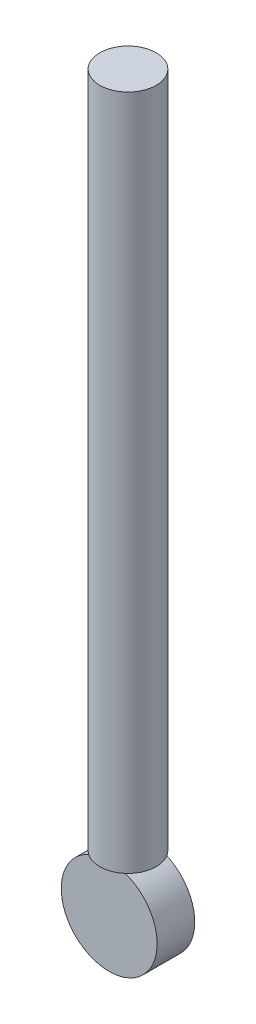
ISO-10303-21;
HEADER;
FILE_DESCRIPTION(('STEP AP214'),'2;1');
FILE_NAME('part.step','',(''),(''),'','','');
FILE_SCHEMA(('AUTOMOTIVE_DESIGN { 1 0 10303 214 1 1 1 1 }'));
ENDSEC;
DATA;
#1=APPLICATION_CONTEXT('core data for automotive mechanical design processes');
#2=APPLICATION_PROTOCOL_DEFINITION('international standard','automotive_design',2000,#1);
#3=PRODUCT_CONTEXT('',#1,'mechanical');
#4=PRODUCT('Part','Part','',(#3));
#5=PRODUCT_RELATED_PRODUCT_CATEGORY('part','',(#4));
#6=PRODUCT_DEFINITION_FORMATION('','',#4);
#7=PRODUCT_DEFINITION_CONTEXT('part definition',#1,'design');
#8=PRODUCT_DEFINITION('design','',#6,#7);
#9=PRODUCT_DEFINITION_SHAPE('','',#8);
#10=(LENGTH_UNIT() NAMED_UNIT(*) SI_UNIT(.MILLI.,.METRE.));
#11=(NAMED_UNIT(*) PLANE_ANGLE_UNIT() SI_UNIT($,.RADIAN.));
#12=(NAMED_UNIT(*) SI_UNIT($,.STERADIAN.) SOLID_ANGLE_UNIT());
#13=UNCERTAINTY_MEASURE_WITH_UNIT(LENGTH_MEASURE(1.E-05),#10,'distance_accuracy_value','');
#14=(GEOMETRIC_REPRESENTATION_CONTEXT(3) GLOBAL_UNCERTAINTY_ASSIGNED_CONTEXT((#13)) GLOBAL_UNIT_ASSIGNED_CONTEXT((#10,
#11,#12)) REPRESENTATION_CONTEXT('',''));
#15=CARTESIAN_POINT('',(0.,0.,0.));
#16=DIRECTION('',(0.,0.,1.));
#17=DIRECTION('',(1.,0.,0.));
#18=AXIS2_PLACEMENT_3D('',#15,#16,#17);
#19=CARTESIAN_POINT('',(0.,228.6,0.));
#20=DIRECTION('',(0.,-1.,0.));
#21=DIRECTION('',(0.,0.,-1.));
#22=AXIS2_PLACEMENT_3D('',#19,#20,#21);
#23=CYLINDRICAL_SURFACE('',#22,9.525);
#24=CARTESIAN_POINT('',(0.,228.6,0.));
#25=DIRECTION('',(0.,1.,0.));
#26=DIRECTION('',(0.,0.,1.));
#27=AXIS2_PLACEMENT_3D('',#24,#25,#26);
#28=CIRCLE('',#27,9.525);
#29=CARTESIAN_POINT('',(0.,228.6,9.525));
#30=VERTEX_POINT('',#29);
#31=EDGE_CURVE('E75',#30,#30,#28,.T.);
#32=ORIENTED_EDGE('',*,*,#31,.F.);
#33=EDGE_LOOP('',(#32));
#34=FACE_BOUND('',#33,.T.);
#35=CARTESIAN_POINT('',(0.,0.,0.));
#36=DIRECTION('',(0.,1.,0.));
#37=DIRECTION('',(0.,0.,1.));
#38=AXIS2_PLACEMENT_3D('',#35,#36,#37);
#39=CIRCLE('',#38,9.525);
#40=CARTESIAN_POINT('',(0.,0.,9.525));
#41=VERTEX_POINT('',#40);
#42=EDGE_CURVE('E82',#41,#41,#39,.T.);
#43=ORIENTED_EDGE('',*,*,#42,.T.);
#44=EDGE_LOOP('',(#43));
#45=FACE_BOUND('',#44,.T.);
#46=ADVANCED_FACE('F39',(#34,#45),#23,.T.);
#47=CARTESIAN_POINT('',(0.,228.6,0.));
#48=DIRECTION('',(0.,1.,0.));
#49=DIRECTION('',(0.,0.,1.));
#50=AXIS2_PLACEMENT_3D('',#47,#48,#49);
#51=PLANE('',#50);
#52=ORIENTED_EDGE('',*,*,#31,.T.);
#53=EDGE_LOOP('',(#52));
#54=FACE_BOUND('',#53,.T.);
#55=ADVANCED_FACE('F95',(#54),#51,.T.);
#56=CARTESIAN_POINT('',(0.,0.,0.));
#57=DIRECTION('',(0.,1.,0.));
#58=DIRECTION('',(0.,0.,1.));
#59=AXIS2_PLACEMENT_3D('',#56,#57,#58);
#60=PLANE('',#59);
#61=DIRECTION('',(0.,0.,-1.));
#62=VECTOR('',#61,1.);
#63=CARTESIAN_POINT('',(-2.25725391322138,0.,6.35));
#64=LINE('',#63,#62);
#65=CARTESIAN_POINT('',(-2.25725391322138,0.,6.35));
#66=VERTEX_POINT('',#65);
#67=CARTESIAN_POINT('',(-2.25725391322138,0.,-6.35));
#68=VERTEX_POINT('',#67);
#69=EDGE_CURVE('E57',#66,#68,#64,.T.);
#70=ORIENTED_EDGE('',*,*,#69,.F.);
#71=DIRECTION('',(1.,0.,0.));
#72=VECTOR('',#71,1.);
#73=CARTESIAN_POINT('',(0.,0.,6.35));
#74=LINE('',#73,#72);
#75=CARTESIAN_POINT('',(2.25725391322138,0.,6.35));
#76=VERTEX_POINT('',#75);
#77=EDGE_CURVE('E11',#66,#76,#74,.T.);
#78=ORIENTED_EDGE('',*,*,#77,.T.);
#79=DIRECTION('',(0.,0.,-1.));
#80=VECTOR('',#79,1.);
#81=CARTESIAN_POINT('',(2.25725391322138,0.,6.35));
#82=LINE('',#81,#80);
#83=CARTESIAN_POINT('',(2.25725391322138,0.,-6.35));
#84=VERTEX_POINT('',#83);
#85=EDGE_CURVE('E47',#84,#76,#82,.F.);
#86=ORIENTED_EDGE('',*,*,#85,.F.);
#87=DIRECTION('',(1.,0.,0.));
#88=VECTOR('',#87,1.);
#89=CARTESIAN_POINT('',(0.,0.,-6.35));
#90=LINE('',#89,#88);
#91=EDGE_CURVE('E64',#68,#84,#90,.T.);
#92=ORIENTED_EDGE('',*,*,#91,.F.);
#93=EDGE_LOOP('',(#70,#78,#86,#92));
#94=FACE_BOUND('',#93,.T.);
#95=ORIENTED_EDGE('',*,*,#42,.F.);
#96=EDGE_LOOP('',(#95));
#97=FACE_BOUND('',#96,.T.);
#98=ADVANCED_FACE('F62',(#94,#97),#60,.F.);
#99=CARTESIAN_POINT('',(0.,-16.0399674502827,6.35));
#100=DIRECTION('',(0.,0.,-1.));
#101=DIRECTION('',(-1.,0.,0.));
#102=AXIS2_PLACEMENT_3D('',#99,#100,#101);
#103=CYLINDRICAL_SURFACE('',#102,16.1980168858685);
#104=CARTESIAN_POINT('',(0.,-16.0399674502827,-6.35));
#105=DIRECTION('',(0.,0.,1.));
#106=DIRECTION('',(1.,0.,0.));
#107=AXIS2_PLACEMENT_3D('',#104,#105,#106);
#108=CIRCLE('',#107,16.1980168858685);
#109=EDGE_CURVE('E73',#68,#84,#108,.T.);
#110=ORIENTED_EDGE('',*,*,#109,.T.);
#111=ORIENTED_EDGE('',*,*,#85,.T.);
#112=CARTESIAN_POINT('',(0.,-16.0399674502827,6.35));
#113=DIRECTION('',(0.,0.,1.));
#114=DIRECTION('',(1.,0.,0.));
#115=AXIS2_PLACEMENT_3D('',#112,#113,#114);
#116=CIRCLE('',#115,16.1980168858685);
#117=EDGE_CURVE('E79',#66,#76,#116,.T.);
#118=ORIENTED_EDGE('',*,*,#117,.F.);
#119=ORIENTED_EDGE('',*,*,#69,.T.);
#120=EDGE_LOOP('',(#110,#111,#118,#119));
#121=FACE_BOUND('',#120,.T.);
#122=ADVANCED_FACE('F77',(#121),#103,.T.);
#123=CARTESIAN_POINT('',(0.,-16.0399674502827,6.35));
#124=DIRECTION('',(0.,0.,1.));
#125=DIRECTION('',(1.,0.,0.));
#126=AXIS2_PLACEMENT_3D('',#123,#124,#125);
#127=PLANE('',#126);
#128=ORIENTED_EDGE('',*,*,#77,.F.);
#129=ORIENTED_EDGE('',*,*,#117,.T.);
#130=EDGE_LOOP('',(#128,#129));
#131=FACE_BOUND('',#130,.T.);
#132=ADVANCED_FACE('F100',(#131),#127,.T.);
#133=CARTESIAN_POINT('',(0.,-16.0399674502827,-6.35));
#134=DIRECTION('',(0.,0.,1.));
#135=DIRECTION('',(1.,0.,0.));
#136=AXIS2_PLACEMENT_3D('',#133,#134,#135);
#137=PLANE('',#136);
#138=ORIENTED_EDGE('',*,*,#109,.F.);
#139=ORIENTED_EDGE('',*,*,#91,.T.);
#140=EDGE_LOOP('',(#138,#139));
#141=FACE_BOUND('',#140,.T.);
#142=ADVANCED_FACE('F72',(#141),#137,.F.);
#143=CLOSED_SHELL('',(#46,#55,#98,#122,#132,#142));
#144=MANIFOLD_SOLID_BREP('B2',#143);
#145=ADVANCED_BREP_SHAPE_REPRESENTATION('',(#18,#144),#14);
#146=SHAPE_DEFINITION_REPRESENTATION(#9,#145);
ENDSEC;
END-ISO-10303-21;
